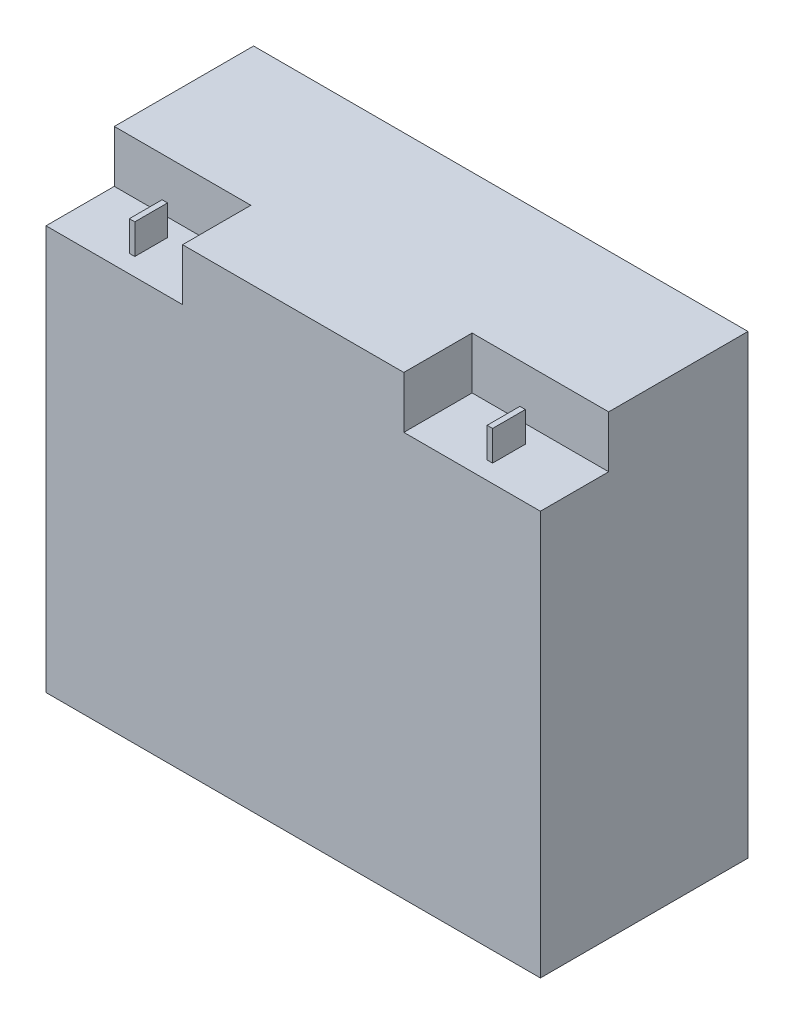
ISO-10303-21;
HEADER;
FILE_DESCRIPTION(('STEP AP214'),'2;1');
FILE_NAME('part.step','',(''),(''),'','','');
FILE_SCHEMA(('AUTOMOTIVE_DESIGN { 1 0 10303 214 1 1 1 1 }'));
ENDSEC;
DATA;
#1=APPLICATION_CONTEXT('core data for automotive mechanical design processes');
#2=APPLICATION_PROTOCOL_DEFINITION('international standard','automotive_design',2000,#1);
#3=PRODUCT_CONTEXT('',#1,'mechanical');
#4=PRODUCT('Part','Part','',(#3));
#5=PRODUCT_RELATED_PRODUCT_CATEGORY('part','',(#4));
#6=PRODUCT_DEFINITION_FORMATION('','',#4);
#7=PRODUCT_DEFINITION_CONTEXT('part definition',#1,'design');
#8=PRODUCT_DEFINITION('design','',#6,#7);
#9=PRODUCT_DEFINITION_SHAPE('','',#8);
#10=(LENGTH_UNIT() NAMED_UNIT(*) SI_UNIT(.MILLI.,.METRE.));
#11=(NAMED_UNIT(*) PLANE_ANGLE_UNIT() SI_UNIT($,.RADIAN.));
#12=(NAMED_UNIT(*) SI_UNIT($,.STERADIAN.) SOLID_ANGLE_UNIT());
#13=UNCERTAINTY_MEASURE_WITH_UNIT(LENGTH_MEASURE(1.E-05),#10,'distance_accuracy_value','');
#14=(GEOMETRIC_REPRESENTATION_CONTEXT(3) GLOBAL_UNCERTAINTY_ASSIGNED_CONTEXT((#13)) GLOBAL_UNIT_ASSIGNED_CONTEXT((#10,
#11,#12)) REPRESENTATION_CONTEXT('',''));
#15=CARTESIAN_POINT('',(0.,0.,0.));
#16=DIRECTION('',(0.,0.,1.));
#17=DIRECTION('',(1.,0.,0.));
#18=AXIS2_PLACEMENT_3D('',#15,#16,#17);
#19=CARTESIAN_POINT('',(90.5,64.5,13.));
#20=DIRECTION('',(0.,-1.,0.));
#21=DIRECTION('',(0.,0.,-1.));
#22=AXIS2_PLACEMENT_3D('',#19,#20,#21);
#23=PLANE('',#22);
#24=DIRECTION('',(1.,0.,0.));
#25=VECTOR('',#24,1.);
#26=CARTESIAN_POINT('',(90.5,64.5,38.));
#27=LINE('',#26,#25);
#28=CARTESIAN_POINT('',(40.5,64.5,38.));
#29=VERTEX_POINT('',#28);
#30=CARTESIAN_POINT('',(90.5,64.5,38.));
#31=VERTEX_POINT('',#30);
#32=EDGE_CURVE('E223',#29,#31,#27,.T.);
#33=ORIENTED_EDGE('',*,*,#32,.T.);
#34=DIRECTION('',(0.,0.,1.));
#35=VECTOR('',#34,1.);
#36=CARTESIAN_POINT('',(90.5,64.5,13.));
#37=LINE('',#36,#35);
#38=CARTESIAN_POINT('',(90.5,64.5,13.));
#39=VERTEX_POINT('',#38);
#40=EDGE_CURVE('E236',#39,#31,#37,.T.);
#41=ORIENTED_EDGE('',*,*,#40,.F.);
#42=DIRECTION('',(1.,0.,0.));
#43=VECTOR('',#42,1.);
#44=CARTESIAN_POINT('',(90.5,64.5,13.));
#45=LINE('',#44,#43);
#46=CARTESIAN_POINT('',(40.5,64.5,13.));
#47=VERTEX_POINT('',#46);
#48=EDGE_CURVE('E229',#47,#39,#45,.T.);
#49=ORIENTED_EDGE('',*,*,#48,.F.);
#50=DIRECTION('',(0.,0.,1.));
#51=VECTOR('',#50,1.);
#52=CARTESIAN_POINT('',(40.5,64.5,13.));
#53=LINE('',#52,#51);
#54=EDGE_CURVE('E240',#47,#29,#53,.T.);
#55=ORIENTED_EDGE('',*,*,#54,.T.);
#56=EDGE_LOOP('',(#33,#41,#49,#55));
#57=FACE_BOUND('',#56,.T.);
#58=DIRECTION('',(0.,0.,1.));
#59=VECTOR('',#58,1.);
#60=CARTESIAN_POINT('',(64.5,64.5,19.5));
#61=LINE('',#60,#59);
#62=CARTESIAN_POINT('',(64.5,64.5,19.5));
#63=VERTEX_POINT('',#62);
#64=CARTESIAN_POINT('',(64.5,64.5,31.5));
#65=VERTEX_POINT('',#64);
#66=EDGE_CURVE('E180',#63,#65,#61,.T.);
#67=ORIENTED_EDGE('',*,*,#66,.F.);
#68=DIRECTION('',(-1.,0.,0.));
#69=VECTOR('',#68,1.);
#70=CARTESIAN_POINT('',(64.5,64.5,19.5));
#71=LINE('',#70,#69);
#72=CARTESIAN_POINT('',(66.5,64.5,19.5));
#73=VERTEX_POINT('',#72);
#74=EDGE_CURVE('E177',#73,#63,#71,.T.);
#75=ORIENTED_EDGE('',*,*,#74,.F.);
#76=DIRECTION('',(0.,0.,-1.));
#77=VECTOR('',#76,1.);
#78=CARTESIAN_POINT('',(66.5,64.5,19.5));
#79=LINE('',#78,#77);
#80=CARTESIAN_POINT('',(66.5,64.5,31.5));
#81=VERTEX_POINT('',#80);
#82=EDGE_CURVE('E56',#81,#73,#79,.T.);
#83=ORIENTED_EDGE('',*,*,#82,.F.);
#84=DIRECTION('',(1.,0.,0.));
#85=VECTOR('',#84,1.);
#86=CARTESIAN_POINT('',(64.5,64.5,31.5));
#87=LINE('',#86,#85);
#88=EDGE_CURVE('E51',#65,#81,#87,.T.);
#89=ORIENTED_EDGE('',*,*,#88,.F.);
#90=EDGE_LOOP('',(#67,#75,#83,#89));
#91=FACE_BOUND('',#90,.T.);
#92=ADVANCED_FACE('F36',(#57,#91),#23,.F.);
#93=CARTESIAN_POINT('',(-90.5,64.5,13.));
#94=DIRECTION('',(0.,-1.,0.));
#95=DIRECTION('',(0.,0.,-1.));
#96=AXIS2_PLACEMENT_3D('',#93,#94,#95);
#97=PLANE('',#96);
#98=DIRECTION('',(1.,0.,0.));
#99=VECTOR('',#98,1.);
#100=CARTESIAN_POINT('',(-90.5,64.5,38.));
#101=LINE('',#100,#99);
#102=CARTESIAN_POINT('',(-90.5,64.5,38.));
#103=VERTEX_POINT('',#102);
#104=CARTESIAN_POINT('',(-40.5,64.5,38.));
#105=VERTEX_POINT('',#104);
#106=EDGE_CURVE('E239',#103,#105,#101,.T.);
#107=ORIENTED_EDGE('',*,*,#106,.T.);
#108=DIRECTION('',(0.,0.,1.));
#109=VECTOR('',#108,1.);
#110=CARTESIAN_POINT('',(-40.5,64.5,13.));
#111=LINE('',#110,#109);
#112=CARTESIAN_POINT('',(-40.5,64.5,13.));
#113=VERTEX_POINT('',#112);
#114=EDGE_CURVE('E264',#113,#105,#111,.T.);
#115=ORIENTED_EDGE('',*,*,#114,.F.);
#116=DIRECTION('',(1.,0.,0.));
#117=VECTOR('',#116,1.);
#118=CARTESIAN_POINT('',(-90.5,64.5,13.));
#119=LINE('',#118,#117);
#120=CARTESIAN_POINT('',(-90.5,64.5,13.));
#121=VERTEX_POINT('',#120);
#122=EDGE_CURVE('E246',#121,#113,#119,.T.);
#123=ORIENTED_EDGE('',*,*,#122,.F.);
#124=DIRECTION('',(0.,0.,1.));
#125=VECTOR('',#124,1.);
#126=CARTESIAN_POINT('',(-90.5,64.5,13.));
#127=LINE('',#126,#125);
#128=EDGE_CURVE('E255',#121,#103,#127,.T.);
#129=ORIENTED_EDGE('',*,*,#128,.T.);
#130=EDGE_LOOP('',(#107,#115,#123,#129));
#131=FACE_BOUND('',#130,.T.);
#132=DIRECTION('',(0.,0.,1.));
#133=VECTOR('',#132,1.);
#134=CARTESIAN_POINT('',(-66.5,64.5,19.5));
#135=LINE('',#134,#133);
#136=CARTESIAN_POINT('',(-66.5,64.5,19.5));
#137=VERTEX_POINT('',#136);
#138=CARTESIAN_POINT('',(-66.5,64.5,31.5));
#139=VERTEX_POINT('',#138);
#140=EDGE_CURVE('E181',#137,#139,#135,.T.);
#141=ORIENTED_EDGE('',*,*,#140,.F.);
#142=DIRECTION('',(-1.,0.,0.));
#143=VECTOR('',#142,1.);
#144=CARTESIAN_POINT('',(-66.5,64.5,19.5));
#145=LINE('',#144,#143);
#146=CARTESIAN_POINT('',(-64.5,64.5,19.5));
#147=VERTEX_POINT('',#146);
#148=EDGE_CURVE('E194',#147,#137,#145,.T.);
#149=ORIENTED_EDGE('',*,*,#148,.F.);
#150=DIRECTION('',(0.,0.,-1.));
#151=VECTOR('',#150,1.);
#152=CARTESIAN_POINT('',(-64.5,64.5,19.5));
#153=LINE('',#152,#151);
#154=CARTESIAN_POINT('',(-64.5,64.5,31.5));
#155=VERTEX_POINT('',#154);
#156=EDGE_CURVE('E203',#155,#147,#153,.T.);
#157=ORIENTED_EDGE('',*,*,#156,.F.);
#158=DIRECTION('',(1.,0.,0.));
#159=VECTOR('',#158,1.);
#160=CARTESIAN_POINT('',(-66.5,64.5,31.5));
#161=LINE('',#160,#159);
#162=EDGE_CURVE('E184',#139,#155,#161,.T.);
#163=ORIENTED_EDGE('',*,*,#162,.F.);
#164=EDGE_LOOP('',(#141,#149,#157,#163));
#165=FACE_BOUND('',#164,.T.);
#166=ADVANCED_FACE('F323',(#131,#165),#97,.F.);
#167=CARTESIAN_POINT('',(90.5,-83.5,38.));
#168=DIRECTION('',(-1.,0.,0.));
#169=DIRECTION('',(0.,0.,1.));
#170=AXIS2_PLACEMENT_3D('',#167,#168,#169);
#171=PLANE('',#170);
#172=DIRECTION('',(0.,1.,0.));
#173=VECTOR('',#172,1.);
#174=CARTESIAN_POINT('',(90.5,83.5,13.));
#175=LINE('',#174,#173);
#176=CARTESIAN_POINT('',(90.5,83.5,13.));
#177=VERTEX_POINT('',#176);
#178=EDGE_CURVE('E220',#39,#177,#175,.T.);
#179=ORIENTED_EDGE('',*,*,#178,.F.);
#180=ORIENTED_EDGE('',*,*,#40,.T.);
#181=DIRECTION('',(0.,1.,0.));
#182=VECTOR('',#181,1.);
#183=CARTESIAN_POINT('',(90.5,-83.5,38.));
#184=LINE('',#183,#182);
#185=CARTESIAN_POINT('',(90.5,-83.5,38.));
#186=VERTEX_POINT('',#185);
#187=EDGE_CURVE('E267',#186,#31,#184,.T.);
#188=ORIENTED_EDGE('',*,*,#187,.F.);
#189=DIRECTION('',(0.,0.,-1.));
#190=VECTOR('',#189,1.);
#191=CARTESIAN_POINT('',(90.5,-83.5,38.));
#192=LINE('',#191,#190);
#193=CARTESIAN_POINT('',(90.5,-83.5,-38.));
#194=VERTEX_POINT('',#193);
#195=EDGE_CURVE('E277',#186,#194,#192,.T.);
#196=ORIENTED_EDGE('',*,*,#195,.T.);
#197=DIRECTION('',(0.,1.,0.));
#198=VECTOR('',#197,1.);
#199=CARTESIAN_POINT('',(90.5,-83.5,-38.));
#200=LINE('',#199,#198);
#201=CARTESIAN_POINT('',(90.5,83.5,-38.));
#202=VERTEX_POINT('',#201);
#203=EDGE_CURVE('E263',#194,#202,#200,.T.);
#204=ORIENTED_EDGE('',*,*,#203,.T.);
#205=DIRECTION('',(0.,0.,-1.));
#206=VECTOR('',#205,1.);
#207=CARTESIAN_POINT('',(90.5,83.5,38.));
#208=LINE('',#207,#206);
#209=EDGE_CURVE('E11',#177,#202,#208,.T.);
#210=ORIENTED_EDGE('',*,*,#209,.F.);
#211=EDGE_LOOP('',(#179,#180,#188,#196,#204,#210));
#212=FACE_BOUND('',#211,.T.);
#213=ADVANCED_FACE('F38',(#212),#171,.F.);
#214=CARTESIAN_POINT('',(-90.5,83.5,38.));
#215=DIRECTION('',(0.,-1.,0.));
#216=DIRECTION('',(0.,0.,-1.));
#217=AXIS2_PLACEMENT_3D('',#214,#215,#216);
#218=PLANE('',#217);
#219=DIRECTION('',(-1.,0.,0.));
#220=VECTOR('',#219,1.);
#221=CARTESIAN_POINT('',(-90.5,83.5,38.));
#222=LINE('',#221,#220);
#223=CARTESIAN_POINT('',(40.5,83.5,38.));
#224=VERTEX_POINT('',#223);
#225=CARTESIAN_POINT('',(-40.5,83.5,38.));
#226=VERTEX_POINT('',#225);
#227=EDGE_CURVE('E270',#224,#226,#222,.T.);
#228=ORIENTED_EDGE('',*,*,#227,.F.);
#229=DIRECTION('',(0.,0.,1.));
#230=VECTOR('',#229,1.);
#231=CARTESIAN_POINT('',(40.5,83.5,13.));
#232=LINE('',#231,#230);
#233=CARTESIAN_POINT('',(40.5,83.5,13.));
#234=VERTEX_POINT('',#233);
#235=EDGE_CURVE('E232',#234,#224,#232,.T.);
#236=ORIENTED_EDGE('',*,*,#235,.F.);
#237=DIRECTION('',(-1.,0.,0.));
#238=VECTOR('',#237,1.);
#239=CARTESIAN_POINT('',(90.5,83.5,13.));
#240=LINE('',#239,#238);
#241=EDGE_CURVE('E222',#177,#234,#240,.T.);
#242=ORIENTED_EDGE('',*,*,#241,.F.);
#243=ORIENTED_EDGE('',*,*,#209,.T.);
#244=DIRECTION('',(-1.,0.,0.));
#245=VECTOR('',#244,1.);
#246=CARTESIAN_POINT('',(-90.5,83.5,-38.));
#247=LINE('',#246,#245);
#248=CARTESIAN_POINT('',(-90.5,83.5,-38.));
#249=VERTEX_POINT('',#248);
#250=EDGE_CURVE('E280',#202,#249,#247,.T.);
#251=ORIENTED_EDGE('',*,*,#250,.T.);
#252=DIRECTION('',(0.,0.,-1.));
#253=VECTOR('',#252,1.);
#254=CARTESIAN_POINT('',(-90.5,83.5,38.));
#255=LINE('',#254,#253);
#256=CARTESIAN_POINT('',(-90.5,83.5,13.));
#257=VERTEX_POINT('',#256);
#258=EDGE_CURVE('E44',#257,#249,#255,.T.);
#259=ORIENTED_EDGE('',*,*,#258,.F.);
#260=DIRECTION('',(-1.,0.,0.));
#261=VECTOR('',#260,1.);
#262=CARTESIAN_POINT('',(-90.5,83.5,13.));
#263=LINE('',#262,#261);
#264=CARTESIAN_POINT('',(-40.5,83.5,13.));
#265=VERTEX_POINT('',#264);
#266=EDGE_CURVE('E253',#265,#257,#263,.T.);
#267=ORIENTED_EDGE('',*,*,#266,.F.);
#268=DIRECTION('',(0.,0.,1.));
#269=VECTOR('',#268,1.);
#270=CARTESIAN_POINT('',(-40.5,83.5,13.));
#271=LINE('',#270,#269);
#272=EDGE_CURVE('E260',#265,#226,#271,.T.);
#273=ORIENTED_EDGE('',*,*,#272,.T.);
#274=EDGE_LOOP('',(#228,#236,#242,#243,#251,#259,#267,#273));
#275=FACE_BOUND('',#274,.T.);
#276=ADVANCED_FACE('F302',(#275),#218,.F.);
#277=CARTESIAN_POINT('',(-90.5,-83.5,38.));
#278=DIRECTION('',(1.,0.,0.));
#279=DIRECTION('',(0.,1.,0.));
#280=AXIS2_PLACEMENT_3D('',#277,#278,#279);
#281=PLANE('',#280);
#282=DIRECTION('',(0.,-1.,0.));
#283=VECTOR('',#282,1.);
#284=CARTESIAN_POINT('',(-90.5,-83.5,38.));
#285=LINE('',#284,#283);
#286=CARTESIAN_POINT('',(-90.5,-83.5,38.));
#287=VERTEX_POINT('',#286);
#288=EDGE_CURVE('E273',#103,#287,#285,.T.);
#289=ORIENTED_EDGE('',*,*,#288,.F.);
#290=ORIENTED_EDGE('',*,*,#128,.F.);
#291=DIRECTION('',(0.,-1.,0.));
#292=VECTOR('',#291,1.);
#293=CARTESIAN_POINT('',(-90.5,83.5,13.));
#294=LINE('',#293,#292);
#295=EDGE_CURVE('E243',#257,#121,#294,.T.);
#296=ORIENTED_EDGE('',*,*,#295,.F.);
#297=ORIENTED_EDGE('',*,*,#258,.T.);
#298=DIRECTION('',(0.,-1.,0.));
#299=VECTOR('',#298,1.);
#300=CARTESIAN_POINT('',(-90.5,-83.5,-38.));
#301=LINE('',#300,#299);
#302=CARTESIAN_POINT('',(-90.5,-83.5,-38.));
#303=VERTEX_POINT('',#302);
#304=EDGE_CURVE('E283',#249,#303,#301,.T.);
#305=ORIENTED_EDGE('',*,*,#304,.T.);
#306=DIRECTION('',(0.,0.,-1.));
#307=VECTOR('',#306,1.);
#308=CARTESIAN_POINT('',(-90.5,-83.5,38.));
#309=LINE('',#308,#307);
#310=EDGE_CURVE('E288',#287,#303,#309,.T.);
#311=ORIENTED_EDGE('',*,*,#310,.F.);
#312=EDGE_LOOP('',(#289,#290,#296,#297,#305,#311));
#313=FACE_BOUND('',#312,.T.);
#314=ADVANCED_FACE('F294',(#313),#281,.F.);
#315=CARTESIAN_POINT('',(-90.5,-83.5,38.));
#316=DIRECTION('',(0.,1.,0.));
#317=DIRECTION('',(0.,0.,1.));
#318=AXIS2_PLACEMENT_3D('',#315,#316,#317);
#319=PLANE('',#318);
#320=DIRECTION('',(1.,0.,0.));
#321=VECTOR('',#320,1.);
#322=CARTESIAN_POINT('',(-90.5,-83.5,-38.));
#323=LINE('',#322,#321);
#324=EDGE_CURVE('E271',#303,#194,#323,.T.);
#325=ORIENTED_EDGE('',*,*,#324,.T.);
#326=ORIENTED_EDGE('',*,*,#195,.F.);
#327=DIRECTION('',(1.,0.,0.));
#328=VECTOR('',#327,1.);
#329=CARTESIAN_POINT('',(-90.5,-83.5,38.));
#330=LINE('',#329,#328);
#331=EDGE_CURVE('E275',#287,#186,#330,.T.);
#332=ORIENTED_EDGE('',*,*,#331,.F.);
#333=ORIENTED_EDGE('',*,*,#310,.T.);
#334=EDGE_LOOP('',(#325,#326,#332,#333));
#335=FACE_BOUND('',#334,.T.);
#336=ADVANCED_FACE('F311',(#335),#319,.F.);
#337=CARTESIAN_POINT('',(0.,0.,38.));
#338=DIRECTION('',(0.,0.,-1.));
#339=DIRECTION('',(-1.,0.,0.));
#340=AXIS2_PLACEMENT_3D('',#337,#338,#339);
#341=PLANE('',#340);
#342=ORIENTED_EDGE('',*,*,#187,.T.);
#343=ORIENTED_EDGE('',*,*,#32,.F.);
#344=DIRECTION('',(0.,-1.,0.));
#345=VECTOR('',#344,1.);
#346=CARTESIAN_POINT('',(40.5,83.5,38.));
#347=LINE('',#346,#345);
#348=EDGE_CURVE('E219',#224,#29,#347,.T.);
#349=ORIENTED_EDGE('',*,*,#348,.F.);
#350=ORIENTED_EDGE('',*,*,#227,.T.);
#351=DIRECTION('',(0.,1.,0.));
#352=VECTOR('',#351,1.);
#353=CARTESIAN_POINT('',(-40.5,83.5,38.));
#354=LINE('',#353,#352);
#355=EDGE_CURVE('E247',#105,#226,#354,.T.);
#356=ORIENTED_EDGE('',*,*,#355,.F.);
#357=ORIENTED_EDGE('',*,*,#106,.F.);
#358=ORIENTED_EDGE('',*,*,#288,.T.);
#359=ORIENTED_EDGE('',*,*,#331,.T.);
#360=EDGE_LOOP('',(#342,#343,#349,#350,#356,#357,#358,#359));
#361=FACE_BOUND('',#360,.T.);
#362=ADVANCED_FACE('F318',(#361),#341,.F.);
#363=CARTESIAN_POINT('',(0.,0.,-38.));
#364=DIRECTION('',(0.,0.,-1.));
#365=DIRECTION('',(-1.,0.,0.));
#366=AXIS2_PLACEMENT_3D('',#363,#364,#365);
#367=PLANE('',#366);
#368=ORIENTED_EDGE('',*,*,#203,.F.);
#369=ORIENTED_EDGE('',*,*,#324,.F.);
#370=ORIENTED_EDGE('',*,*,#304,.F.);
#371=ORIENTED_EDGE('',*,*,#250,.F.);
#372=EDGE_LOOP('',(#368,#369,#370,#371));
#373=FACE_BOUND('',#372,.T.);
#374=ADVANCED_FACE('F308',(#373),#367,.T.);
#375=CARTESIAN_POINT('',(-40.5,83.5,13.));
#376=DIRECTION('',(1.,0.,0.));
#377=DIRECTION('',(0.,0.,-1.));
#378=AXIS2_PLACEMENT_3D('',#375,#376,#377);
#379=PLANE('',#378);
#380=ORIENTED_EDGE('',*,*,#355,.T.);
#381=ORIENTED_EDGE('',*,*,#272,.F.);
#382=DIRECTION('',(0.,1.,0.));
#383=VECTOR('',#382,1.);
#384=CARTESIAN_POINT('',(-40.5,83.5,13.));
#385=LINE('',#384,#383);
#386=EDGE_CURVE('E250',#113,#265,#385,.T.);
#387=ORIENTED_EDGE('',*,*,#386,.F.);
#388=ORIENTED_EDGE('',*,*,#114,.T.);
#389=EDGE_LOOP('',(#380,#381,#387,#388));
#390=FACE_BOUND('',#389,.T.);
#391=ADVANCED_FACE('F330',(#390),#379,.F.);
#392=CARTESIAN_POINT('',(0.,0.,13.));
#393=DIRECTION('',(0.,0.,1.));
#394=DIRECTION('',(1.,0.,0.));
#395=AXIS2_PLACEMENT_3D('',#392,#393,#394);
#396=PLANE('',#395);
#397=ORIENTED_EDGE('',*,*,#295,.T.);
#398=ORIENTED_EDGE('',*,*,#122,.T.);
#399=ORIENTED_EDGE('',*,*,#386,.T.);
#400=ORIENTED_EDGE('',*,*,#266,.T.);
#401=EDGE_LOOP('',(#397,#398,#399,#400));
#402=FACE_BOUND('',#401,.T.);
#403=ADVANCED_FACE('F327',(#402),#396,.T.);
#404=CARTESIAN_POINT('',(40.5,83.5,13.));
#405=DIRECTION('',(-1.,0.,0.));
#406=DIRECTION('',(0.,0.,1.));
#407=AXIS2_PLACEMENT_3D('',#404,#405,#406);
#408=PLANE('',#407);
#409=ORIENTED_EDGE('',*,*,#348,.T.);
#410=ORIENTED_EDGE('',*,*,#54,.F.);
#411=DIRECTION('',(0.,-1.,0.));
#412=VECTOR('',#411,1.);
#413=CARTESIAN_POINT('',(40.5,83.5,13.));
#414=LINE('',#413,#412);
#415=EDGE_CURVE('E226',#234,#47,#414,.T.);
#416=ORIENTED_EDGE('',*,*,#415,.F.);
#417=ORIENTED_EDGE('',*,*,#235,.T.);
#418=EDGE_LOOP('',(#409,#410,#416,#417));
#419=FACE_BOUND('',#418,.T.);
#420=ADVANCED_FACE('F332',(#419),#408,.F.);
#421=CARTESIAN_POINT('',(0.,0.,13.));
#422=DIRECTION('',(0.,0.,-1.));
#423=DIRECTION('',(-1.,0.,0.));
#424=AXIS2_PLACEMENT_3D('',#421,#422,#423);
#425=PLANE('',#424);
#426=ORIENTED_EDGE('',*,*,#178,.T.);
#427=ORIENTED_EDGE('',*,*,#241,.T.);
#428=ORIENTED_EDGE('',*,*,#415,.T.);
#429=ORIENTED_EDGE('',*,*,#48,.T.);
#430=EDGE_LOOP('',(#426,#427,#428,#429));
#431=FACE_BOUND('',#430,.T.);
#432=ADVANCED_FACE('F334',(#431),#425,.F.);
#433=CARTESIAN_POINT('',(-66.5,75.5,19.5));
#434=DIRECTION('',(1.,0.,0.));
#435=DIRECTION('',(0.,0.,-1.));
#436=AXIS2_PLACEMENT_3D('',#433,#434,#435);
#437=PLANE('',#436);
#438=ORIENTED_EDGE('',*,*,#140,.T.);
#439=DIRECTION('',(0.,-1.,0.));
#440=VECTOR('',#439,1.);
#441=CARTESIAN_POINT('',(-66.5,75.5,31.5));
#442=LINE('',#441,#440);
#443=CARTESIAN_POINT('',(-66.5,75.5,31.5));
#444=VERTEX_POINT('',#443);
#445=EDGE_CURVE('E216',#444,#139,#442,.T.);
#446=ORIENTED_EDGE('',*,*,#445,.F.);
#447=DIRECTION('',(0.,0.,1.));
#448=VECTOR('',#447,1.);
#449=CARTESIAN_POINT('',(-66.5,75.5,19.5));
#450=LINE('',#449,#448);
#451=CARTESIAN_POINT('',(-66.5,75.5,19.5));
#452=VERTEX_POINT('',#451);
#453=EDGE_CURVE('E190',#452,#444,#450,.T.);
#454=ORIENTED_EDGE('',*,*,#453,.F.);
#455=DIRECTION('',(0.,-1.,0.));
#456=VECTOR('',#455,1.);
#457=CARTESIAN_POINT('',(-66.5,75.5,19.5));
#458=LINE('',#457,#456);
#459=EDGE_CURVE('E199',#452,#137,#458,.T.);
#460=ORIENTED_EDGE('',*,*,#459,.T.);
#461=EDGE_LOOP('',(#438,#446,#454,#460));
#462=FACE_BOUND('',#461,.T.);
#463=ADVANCED_FACE('F381',(#462),#437,.F.);
#464=CARTESIAN_POINT('',(-66.5,75.5,31.5));
#465=DIRECTION('',(0.,0.,-1.));
#466=DIRECTION('',(-1.,0.,0.));
#467=AXIS2_PLACEMENT_3D('',#464,#465,#466);
#468=PLANE('',#467);
#469=ORIENTED_EDGE('',*,*,#162,.T.);
#470=DIRECTION('',(0.,-1.,0.));
#471=VECTOR('',#470,1.);
#472=CARTESIAN_POINT('',(-64.5,75.5,31.5));
#473=LINE('',#472,#471);
#474=CARTESIAN_POINT('',(-64.5,75.5,31.5));
#475=VERTEX_POINT('',#474);
#476=EDGE_CURVE('E213',#475,#155,#473,.T.);
#477=ORIENTED_EDGE('',*,*,#476,.F.);
#478=DIRECTION('',(1.,0.,0.));
#479=VECTOR('',#478,1.);
#480=CARTESIAN_POINT('',(-66.5,75.5,31.5));
#481=LINE('',#480,#479);
#482=EDGE_CURVE('E193',#444,#475,#481,.T.);
#483=ORIENTED_EDGE('',*,*,#482,.F.);
#484=ORIENTED_EDGE('',*,*,#445,.T.);
#485=EDGE_LOOP('',(#469,#477,#483,#484));
#486=FACE_BOUND('',#485,.T.);
#487=ADVANCED_FACE('F377',(#486),#468,.F.);
#488=CARTESIAN_POINT('',(-64.5,75.5,19.5));
#489=DIRECTION('',(-1.,0.,0.));
#490=DIRECTION('',(0.,0.,1.));
#491=AXIS2_PLACEMENT_3D('',#488,#489,#490);
#492=PLANE('',#491);
#493=ORIENTED_EDGE('',*,*,#156,.T.);
#494=DIRECTION('',(0.,-1.,0.));
#495=VECTOR('',#494,1.);
#496=CARTESIAN_POINT('',(-64.5,75.5,19.5));
#497=LINE('',#496,#495);
#498=CARTESIAN_POINT('',(-64.5,75.5,19.5));
#499=VERTEX_POINT('',#498);
#500=EDGE_CURVE('E210',#499,#147,#497,.T.);
#501=ORIENTED_EDGE('',*,*,#500,.F.);
#502=DIRECTION('',(0.,0.,-1.));
#503=VECTOR('',#502,1.);
#504=CARTESIAN_POINT('',(-64.5,75.5,19.5));
#505=LINE('',#504,#503);
#506=EDGE_CURVE('E196',#475,#499,#505,.T.);
#507=ORIENTED_EDGE('',*,*,#506,.F.);
#508=ORIENTED_EDGE('',*,*,#476,.T.);
#509=EDGE_LOOP('',(#493,#501,#507,#508));
#510=FACE_BOUND('',#509,.T.);
#511=ADVANCED_FACE('F373',(#510),#492,.F.);
#512=CARTESIAN_POINT('',(-66.5,75.5,19.5));
#513=DIRECTION('',(0.,0.,1.));
#514=DIRECTION('',(1.,0.,0.));
#515=AXIS2_PLACEMENT_3D('',#512,#513,#514);
#516=PLANE('',#515);
#517=ORIENTED_EDGE('',*,*,#148,.T.);
#518=ORIENTED_EDGE('',*,*,#459,.F.);
#519=DIRECTION('',(-1.,0.,0.));
#520=VECTOR('',#519,1.);
#521=CARTESIAN_POINT('',(-66.5,75.5,19.5));
#522=LINE('',#521,#520);
#523=EDGE_CURVE('E198',#499,#452,#522,.T.);
#524=ORIENTED_EDGE('',*,*,#523,.F.);
#525=ORIENTED_EDGE('',*,*,#500,.T.);
#526=EDGE_LOOP('',(#517,#518,#524,#525));
#527=FACE_BOUND('',#526,.T.);
#528=ADVANCED_FACE('F369',(#527),#516,.F.);
#529=CARTESIAN_POINT('',(0.,75.5,0.));
#530=DIRECTION('',(0.,1.,0.));
#531=DIRECTION('',(0.,0.,1.));
#532=AXIS2_PLACEMENT_3D('',#529,#530,#531);
#533=PLANE('',#532);
#534=ORIENTED_EDGE('',*,*,#453,.T.);
#535=ORIENTED_EDGE('',*,*,#482,.T.);
#536=ORIENTED_EDGE('',*,*,#506,.T.);
#537=ORIENTED_EDGE('',*,*,#523,.T.);
#538=EDGE_LOOP('',(#534,#535,#536,#537));
#539=FACE_BOUND('',#538,.T.);
#540=ADVANCED_FACE('F366',(#539),#533,.T.);
#541=CARTESIAN_POINT('',(64.5,75.5,19.5));
#542=DIRECTION('',(1.,0.,0.));
#543=DIRECTION('',(0.,0.,-1.));
#544=AXIS2_PLACEMENT_3D('',#541,#542,#543);
#545=PLANE('',#544);
#546=ORIENTED_EDGE('',*,*,#66,.T.);
#547=DIRECTION('',(0.,-1.,0.));
#548=VECTOR('',#547,1.);
#549=CARTESIAN_POINT('',(64.5,75.5,31.5));
#550=LINE('',#549,#548);
#551=CARTESIAN_POINT('',(64.5,75.5,31.5));
#552=VERTEX_POINT('',#551);
#553=EDGE_CURVE('E161',#552,#65,#550,.T.);
#554=ORIENTED_EDGE('',*,*,#553,.F.);
#555=DIRECTION('',(0.,0.,1.));
#556=VECTOR('',#555,1.);
#557=CARTESIAN_POINT('',(64.5,75.5,19.5));
#558=LINE('',#557,#556);
#559=CARTESIAN_POINT('',(64.5,75.5,19.5));
#560=VERTEX_POINT('',#559);
#561=EDGE_CURVE('E168',#560,#552,#558,.T.);
#562=ORIENTED_EDGE('',*,*,#561,.F.);
#563=DIRECTION('',(0.,-1.,0.));
#564=VECTOR('',#563,1.);
#565=CARTESIAN_POINT('',(64.5,75.5,19.5));
#566=LINE('',#565,#564);
#567=EDGE_CURVE('E344',#560,#63,#566,.T.);
#568=ORIENTED_EDGE('',*,*,#567,.T.);
#569=EDGE_LOOP('',(#546,#554,#562,#568));
#570=FACE_BOUND('',#569,.T.);
#571=ADVANCED_FACE('F179',(#570),#545,.F.);
#572=CARTESIAN_POINT('',(64.5,75.5,31.5));
#573=DIRECTION('',(0.,0.,-1.));
#574=DIRECTION('',(-1.,0.,0.));
#575=AXIS2_PLACEMENT_3D('',#572,#573,#574);
#576=PLANE('',#575);
#577=ORIENTED_EDGE('',*,*,#88,.T.);
#578=DIRECTION('',(0.,-1.,0.));
#579=VECTOR('',#578,1.);
#580=CARTESIAN_POINT('',(66.5,75.5,31.5));
#581=LINE('',#580,#579);
#582=CARTESIAN_POINT('',(66.5,75.5,31.5));
#583=VERTEX_POINT('',#582);
#584=EDGE_CURVE('E164',#583,#81,#581,.T.);
#585=ORIENTED_EDGE('',*,*,#584,.F.);
#586=DIRECTION('',(1.,0.,0.));
#587=VECTOR('',#586,1.);
#588=CARTESIAN_POINT('',(64.5,75.5,31.5));
#589=LINE('',#588,#587);
#590=EDGE_CURVE('E157',#552,#583,#589,.T.);
#591=ORIENTED_EDGE('',*,*,#590,.F.);
#592=ORIENTED_EDGE('',*,*,#553,.T.);
#593=EDGE_LOOP('',(#577,#585,#591,#592));
#594=FACE_BOUND('',#593,.T.);
#595=ADVANCED_FACE('F159',(#594),#576,.F.);
#596=CARTESIAN_POINT('',(66.5,75.5,19.5));
#597=DIRECTION('',(-1.,0.,0.));
#598=DIRECTION('',(0.,0.,1.));
#599=AXIS2_PLACEMENT_3D('',#596,#597,#598);
#600=PLANE('',#599);
#601=ORIENTED_EDGE('',*,*,#82,.T.);
#602=DIRECTION('',(0.,-1.,0.));
#603=VECTOR('',#602,1.);
#604=CARTESIAN_POINT('',(66.5,75.5,19.5));
#605=LINE('',#604,#603);
#606=CARTESIAN_POINT('',(66.5,75.5,19.5));
#607=VERTEX_POINT('',#606);
#608=EDGE_CURVE('E186',#607,#73,#605,.T.);
#609=ORIENTED_EDGE('',*,*,#608,.F.);
#610=DIRECTION('',(0.,0.,-1.));
#611=VECTOR('',#610,1.);
#612=CARTESIAN_POINT('',(66.5,75.5,19.5));
#613=LINE('',#612,#611);
#614=EDGE_CURVE('E167',#583,#607,#613,.T.);
#615=ORIENTED_EDGE('',*,*,#614,.F.);
#616=ORIENTED_EDGE('',*,*,#584,.T.);
#617=EDGE_LOOP('',(#601,#609,#615,#616));
#618=FACE_BOUND('',#617,.T.);
#619=ADVANCED_FACE('F353',(#618),#600,.F.);
#620=CARTESIAN_POINT('',(64.5,75.5,19.5));
#621=DIRECTION('',(0.,0.,1.));
#622=DIRECTION('',(1.,0.,0.));
#623=AXIS2_PLACEMENT_3D('',#620,#621,#622);
#624=PLANE('',#623);
#625=ORIENTED_EDGE('',*,*,#74,.T.);
#626=ORIENTED_EDGE('',*,*,#567,.F.);
#627=DIRECTION('',(-1.,0.,0.));
#628=VECTOR('',#627,1.);
#629=CARTESIAN_POINT('',(64.5,75.5,19.5));
#630=LINE('',#629,#628);
#631=EDGE_CURVE('E173',#607,#560,#630,.T.);
#632=ORIENTED_EDGE('',*,*,#631,.F.);
#633=ORIENTED_EDGE('',*,*,#608,.T.);
#634=EDGE_LOOP('',(#625,#626,#632,#633));
#635=FACE_BOUND('',#634,.T.);
#636=ADVANCED_FACE('F343',(#635),#624,.F.);
#637=CARTESIAN_POINT('',(0.,75.5,0.));
#638=DIRECTION('',(0.,1.,0.));
#639=DIRECTION('',(0.,0.,1.));
#640=AXIS2_PLACEMENT_3D('',#637,#638,#639);
#641=PLANE('',#640);
#642=ORIENTED_EDGE('',*,*,#561,.T.);
#643=ORIENTED_EDGE('',*,*,#590,.T.);
#644=ORIENTED_EDGE('',*,*,#614,.T.);
#645=ORIENTED_EDGE('',*,*,#631,.T.);
#646=EDGE_LOOP('',(#642,#643,#644,#645));
#647=FACE_BOUND('',#646,.T.);
#648=ADVANCED_FACE('F171',(#647),#641,.T.);
#649=CLOSED_SHELL('',(#92,#166,#213,#276,#314,#336,#362,#374,#391,#403,#420,#432,#463,#487,#511,
#528,#540,#571,#595,#619,#636,#648));
#650=MANIFOLD_SOLID_BREP('B2',#649);
#651=ADVANCED_BREP_SHAPE_REPRESENTATION('',(#18,#650),#14);
#652=SHAPE_DEFINITION_REPRESENTATION(#9,#651);
ENDSEC;
END-ISO-10303-21;
